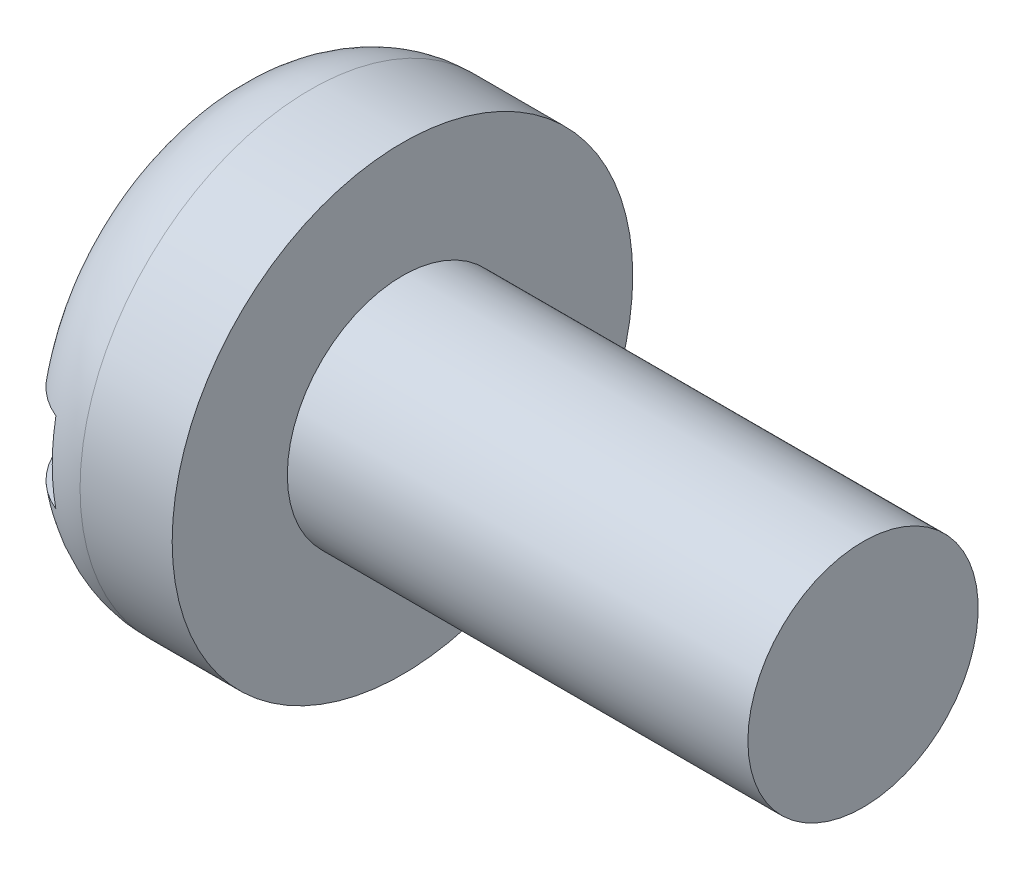
ISO-10303-21;
HEADER;
FILE_DESCRIPTION(('STEP AP214'),'2;1');
FILE_NAME('part.step','',(''),(''),'','','');
FILE_SCHEMA(('AUTOMOTIVE_DESIGN { 1 0 10303 214 1 1 1 1 }'));
ENDSEC;
DATA;
#1=APPLICATION_CONTEXT('core data for automotive mechanical design processes');
#2=APPLICATION_PROTOCOL_DEFINITION('international standard','automotive_design',2000,#1);
#3=PRODUCT_CONTEXT('',#1,'mechanical');
#4=PRODUCT('Part','Part','',(#3));
#5=PRODUCT_RELATED_PRODUCT_CATEGORY('part','',(#4));
#6=PRODUCT_DEFINITION_FORMATION('','',#4);
#7=PRODUCT_DEFINITION_CONTEXT('part definition',#1,'design');
#8=PRODUCT_DEFINITION('design','',#6,#7);
#9=PRODUCT_DEFINITION_SHAPE('','',#8);
#10=(LENGTH_UNIT() NAMED_UNIT(*) SI_UNIT(.MILLI.,.METRE.));
#11=(NAMED_UNIT(*) PLANE_ANGLE_UNIT() SI_UNIT($,.RADIAN.));
#12=(NAMED_UNIT(*) SI_UNIT($,.STERADIAN.) SOLID_ANGLE_UNIT());
#13=UNCERTAINTY_MEASURE_WITH_UNIT(LENGTH_MEASURE(1.E-05),#10,'distance_accuracy_value','');
#14=(GEOMETRIC_REPRESENTATION_CONTEXT(3) GLOBAL_UNCERTAINTY_ASSIGNED_CONTEXT((#13)) GLOBAL_UNIT_ASSIGNED_CONTEXT((#10,
#11,#12)) REPRESENTATION_CONTEXT('',''));
#15=CARTESIAN_POINT('',(0.,0.,0.));
#16=DIRECTION('',(0.,0.,1.));
#17=DIRECTION('',(1.,0.,0.));
#18=AXIS2_PLACEMENT_3D('',#15,#16,#17);
#19=CARTESIAN_POINT('',(0.,0.,0.));
#20=DIRECTION('',(-1.,0.,0.));
#21=DIRECTION('',(0.,0.,1.));
#22=AXIS2_PLACEMENT_3D('',#19,#20,#21);
#23=PLANE('',#22);
#24=DIRECTION('',(0.,0.,-1.));
#25=VECTOR('',#24,1.);
#26=CARTESIAN_POINT('',(0.,0.35,2.));
#27=LINE('',#26,#25);
#28=CARTESIAN_POINT('',(0.,0.35,1.1478240283249));
#29=VERTEX_POINT('',#28);
#30=CARTESIAN_POINT('',(0.,0.35,-1.1478240283249));
#31=VERTEX_POINT('',#30);
#32=EDGE_CURVE('E83',#29,#31,#27,.T.);
#33=ORIENTED_EDGE('',*,*,#32,.F.);
#34=CARTESIAN_POINT('',(0.,0.,0.));
#35=DIRECTION('',(-1.,0.,0.));
#36=DIRECTION('',(0.,0.,1.));
#37=AXIS2_PLACEMENT_3D('',#34,#35,#36);
#38=CIRCLE('',#37,1.2);
#39=EDGE_CURVE('E90',#29,#31,#38,.T.);
#40=ORIENTED_EDGE('',*,*,#39,.T.);
#41=EDGE_LOOP('',(#33,#40));
#42=FACE_BOUND('',#41,.T.);
#43=ADVANCED_FACE('F30',(#42),#23,.T.);
#44=CARTESIAN_POINT('',(-25.4,0.,0.));
#45=DIRECTION('',(-1.,0.,0.));
#46=DIRECTION('',(0.,0.,1.));
#47=AXIS2_PLACEMENT_3D('',#44,#45,#46);
#48=CYLINDRICAL_SURFACE('',#47,1.);
#49=CARTESIAN_POINT('',(5.6,0.,0.));
#50=DIRECTION('',(-1.,0.,0.));
#51=DIRECTION('',(0.,0.,1.));
#52=AXIS2_PLACEMENT_3D('',#49,#50,#51);
#53=CIRCLE('',#52,1.);
#54=CARTESIAN_POINT('',(5.6,0.,1.));
#55=VERTEX_POINT('',#54);
#56=EDGE_CURVE('E94',#55,#55,#53,.T.);
#57=ORIENTED_EDGE('',*,*,#56,.T.);
#58=EDGE_LOOP('',(#57));
#59=FACE_BOUND('',#58,.T.);
#60=CARTESIAN_POINT('',(1.6,0.,0.));
#61=DIRECTION('',(-1.,0.,0.));
#62=DIRECTION('',(0.,0.,1.));
#63=AXIS2_PLACEMENT_3D('',#60,#61,#62);
#64=CIRCLE('',#63,1.);
#65=CARTESIAN_POINT('',(1.6,0.,1.));
#66=VERTEX_POINT('',#65);
#67=EDGE_CURVE('E157',#66,#66,#64,.T.);
#68=ORIENTED_EDGE('',*,*,#67,.F.);
#69=EDGE_LOOP('',(#68));
#70=FACE_BOUND('',#69,.T.);
#71=ADVANCED_FACE('F32',(#59,#70),#48,.T.);
#72=CARTESIAN_POINT('',(5.6,1.,0.));
#73=DIRECTION('',(1.,0.,0.));
#74=DIRECTION('',(0.,0.,-1.));
#75=AXIS2_PLACEMENT_3D('',#72,#73,#74);
#76=PLANE('',#75);
#77=ORIENTED_EDGE('',*,*,#56,.F.);
#78=EDGE_LOOP('',(#77));
#79=FACE_BOUND('',#78,.T.);
#80=ADVANCED_FACE('F143',(#79),#76,.T.);
#81=DIRECTION('',(0.,0.,1.));
#82=VECTOR('',#81,1.);
#83=CARTESIAN_POINT('',(0.,-0.35,-2.));
#84=LINE('',#83,#82);
#85=CARTESIAN_POINT('',(0.,-0.35,-1.1478240283249));
#86=VERTEX_POINT('',#85);
#87=CARTESIAN_POINT('',(0.,-0.35,1.1478240283249));
#88=VERTEX_POINT('',#87);
#89=EDGE_CURVE('E74',#86,#88,#84,.T.);
#90=ORIENTED_EDGE('',*,*,#89,.F.);
#91=EDGE_CURVE('E81',#86,#88,#38,.T.);
#92=ORIENTED_EDGE('',*,*,#91,.T.);
#93=EDGE_LOOP('',(#90,#92));
#94=FACE_BOUND('',#93,.T.);
#95=ADVANCED_FACE('F80',(#94),#23,.T.);
#96=CARTESIAN_POINT('',(0.8,0.,0.));
#97=DIRECTION('',(-1.,0.,0.));
#98=DIRECTION('',(0.,0.,1.));
#99=AXIS2_PLACEMENT_3D('',#96,#97,#98);
#100=TOROIDAL_SURFACE('',#99,1.2,0.8);
#101=CARTESIAN_POINT('',(0.251886964657837,0.35,-1.74803308552626));
#102=CARTESIAN_POINT('',(0.284106185967298,0.35,-1.77894053000279));
#103=CARTESIAN_POINT('',(0.318913450421899,0.35,-1.80714880480359));
#104=CARTESIAN_POINT('',(0.392764045602644,0.35,-1.85733761284793));
#105=CARTESIAN_POINT('',(0.431807289219085,0.35,-1.87931827412407));
#106=CARTESIAN_POINT('',(0.513054117775202,0.35,-1.9163987096586));
#107=CARTESIAN_POINT('',(0.55525887745742,0.35,-1.93149591127619));
#108=CARTESIAN_POINT('',(0.641613804091031,0.35,-1.95434046759959));
#109=CARTESIAN_POINT('',(0.685763953570048,0.35,-1.96208788830284));
#110=CARTESIAN_POINT('',(0.774465039534947,0.35,-1.96997317784989));
#111=CARTESIAN_POINT('',(0.819011860168049,0.35,-1.97015740214389));
#112=CARTESIAN_POINT('',(0.90750040124656,0.35,-1.96302819944338));
#113=CARTESIAN_POINT('',(0.951442136442558,0.35,-1.95571495554893));
#114=CARTESIAN_POINT('',(1.03738817570387,0.35,-1.93383211970242));
#115=CARTESIAN_POINT('',(1.07939605807564,0.35,-1.9192765710464));
#116=CARTESIAN_POINT('',(1.16038685065351,0.35,-1.88334999333501));
#117=CARTESIAN_POINT('',(1.19936974149271,0.35,-1.8619789206491));
#118=CARTESIAN_POINT('',(1.27340405982753,0.35,-1.81294134542017));
#119=CARTESIAN_POINT('',(1.30843691171087,0.35,-1.78524681138814));
#120=CARTESIAN_POINT('',(1.3734217227307,0.35,-1.72443226985518));
#121=CARTESIAN_POINT('',(1.40337349922101,0.35,-1.6913120674053));
#122=CARTESIAN_POINT('',(1.45774858221193,0.35,-1.62017981586091));
#123=CARTESIAN_POINT('',(1.48210165087369,0.35,-1.58211410752388));
#124=CARTESIAN_POINT('',(1.52422592481682,0.35,-1.50250494859893));
#125=CARTESIAN_POINT('',(1.54199667449503,0.35,-1.46096125752214));
#126=CARTESIAN_POINT('',(1.57090761777223,0.35,-1.37460737714393));
#127=CARTESIAN_POINT('',(1.58189252649972,0.35,-1.32974527505676));
#128=CARTESIAN_POINT('',(1.59646688779068,0.35,-1.23884208305886));
#129=CARTESIAN_POINT('',(1.6000553878534,0.35,-1.19280084207285));
#130=CARTESIAN_POINT('',(1.5999412075827,0.35,-1.09898565568804));
#131=CARTESIAN_POINT('',(1.59595668889672,0.35,-1.05121225585408));
#132=CARTESIAN_POINT('',(1.58051554138408,0.35,-0.956902000850774));
#133=CARTESIAN_POINT('',(1.56905773634552,0.35,-0.910365341530719));
#134=CARTESIAN_POINT('',(1.53830789967697,0.35,-0.816640030751649));
#135=CARTESIAN_POINT('',(1.51855977053689,0.35,-0.769601634389602));
#136=CARTESIAN_POINT('',(1.47218777566415,0.35,-0.679051431491683));
#137=CARTESIAN_POINT('',(1.44556043666615,0.35,-0.635541421036113));
#138=CARTESIAN_POINT('',(1.38324599534595,0.35,-0.548261155230435));
#139=CARTESIAN_POINT('',(1.34689115451158,0.35,-0.504969922477862));
#140=CARTESIAN_POINT('',(1.26825683235819,0.35,-0.424127509198641));
#141=CARTESIAN_POINT('',(1.22597536047846,0.35,-0.386578266114273));
#142=CARTESIAN_POINT('',(1.15072803576559,0.35,-0.32910608498835));
#143=CARTESIAN_POINT('',(1.1191159360726,0.35,-0.307389624915311));
#144=CARTESIAN_POINT('',(1.05351876701516,0.35,-0.26776562627417));
#145=CARTESIAN_POINT('',(1.0195345845723,0.35,-0.249856674105417));
#146=CARTESIAN_POINT('',(0.96065969889161,0.35,-0.224864244714228));
#147=CARTESIAN_POINT('',(0.936473030909389,0.35,-0.216158945746235));
#148=CARTESIAN_POINT('',(0.887106020835857,0.35,-0.202605206674377));
#149=CARTESIAN_POINT('',(0.86193133431849,0.35,-0.197737448444988));
#150=CARTESIAN_POINT('',(0.810783523452729,0.35,-0.192964320373583));
#151=CARTESIAN_POINT('',(0.784804569164351,0.35,-0.193116141966727));
#152=CARTESIAN_POINT('',(0.733333382405487,0.35,-0.198492404966462));
#153=CARTESIAN_POINT('',(0.707843238721914,0.35,-0.203735105092492));
#154=CARTESIAN_POINT('',(0.647580830029514,0.35,-0.220980976114015));
#155=CARTESIAN_POINT('',(0.613385828058062,0.35,-0.234894679368622));
#156=CARTESIAN_POINT('',(0.547202579431893,0.35,-0.267318959267038));
#157=CARTESIAN_POINT('',(0.51522497923907,0.35,-0.285849982076015));
#158=CARTESIAN_POINT('',(0.457751191162357,0.35,-0.323360437607254));
#159=CARTESIAN_POINT('',(0.431974418523538,0.35,-0.341913766343738));
#160=CARTESIAN_POINT('',(0.382049961938393,0.35,-0.3811030519923));
#161=CARTESIAN_POINT('',(0.357903152418431,0.35,-0.401740112179063));
#162=CARTESIAN_POINT('',(0.288179326044528,0.35,-0.466439063976135));
#163=CARTESIAN_POINT('',(0.245194257247048,0.35,-0.513371453045039));
#164=CARTESIAN_POINT('',(0.167811086718386,0.35,-0.614139929718161));
#165=CARTESIAN_POINT('',(0.133444025504299,0.35,-0.667999945117915));
#166=CARTESIAN_POINT('',(0.0754909814267591,0.35,-0.781273194679886));
#167=CARTESIAN_POINT('',(0.0518963876977758,0.35,-0.840681947591701));
#168=CARTESIAN_POINT('',(0.0190222494183726,0.35,-0.956707799344828));
#169=CARTESIAN_POINT('',(0.0085119690208978,0.35,-1.01297553527392));
#170=CARTESIAN_POINT('',(-0.00156617385624804,0.35,-1.1264972793032));
#171=CARTESIAN_POINT('',(-0.0011405005997677,0.35,-1.18375068477026));
#172=CARTESIAN_POINT('',(0.0103252237888666,0.35,-1.29044131812036));
#173=CARTESIAN_POINT('',(0.0201263192310197,0.35,-1.34001381873846));
#174=CARTESIAN_POINT('',(0.0484733760745189,0.35,-1.43658734244354));
#175=CARTESIAN_POINT('',(0.067014186401646,0.35,-1.48358986205711));
#176=CARTESIAN_POINT('',(0.110304018114758,0.35,-1.56930412679726));
#177=CARTESIAN_POINT('',(0.134333018852264,0.35,-1.60838106104874));
#178=CARTESIAN_POINT('',(0.188633996751165,0.35,-1.68192512177213));
#179=CARTESIAN_POINT('',(0.218904417878551,0.35,-1.71639339369497));
#180=CARTESIAN_POINT('',(0.251886964657837,0.35,-1.74803308552626));
#181=B_SPLINE_CURVE_WITH_KNOTS('',3,(#101,#102,#103,#104,#105,#106,#107,#108,#109,#110,#111,
#112,#113,#114,#115,#116,#117,#118,#119,#120,#121,#122,#123,#124,#125,#126,#127,#128,#129,#130,
#131,#132,#133,#134,#135,#136,#137,#138,#139,#140,#141,#142,#143,#144,#145,#146,#147,#148,#149,
#150,#151,#152,#153,#154,#155,#156,#157,#158,#159,#160,#161,#162,#163,#164,#165,#166,#167,#168,
#169,#170,#171,#172,#173,#174,#175,#176,#177,#178,#179,#180),.UNSPECIFIED.,.T.,.F.,(4,2,2,2,2,2,
2,2,2,2,2,2,2,2,2,2,2,2,2,2,2,2,2,2,2,2,2,2,2,2,2,2,2,2,2,2,2,2,2,4),(0.,0.133781315953334,
0.267559881316518,0.40138840450072,0.535215725958765,0.668222685556049,0.801226396989754,
0.933973204884136,1.06672086259302,1.20006881741932,1.33342156460409,1.46836564383989,
1.60331906164843,1.7412562268888,1.8792111544044,2.02240092222392,2.16561323195522,
2.31802799031968,2.4705198527409,2.63947463197752,2.80848629415617,2.92336541035193,
3.03820180099507,3.11510771424948,3.19162396716318,3.26901231824847,3.34667925604037,
3.45683323750344,3.56748394622507,3.66264122884862,3.75784916132582,3.94782137520883,
4.13846831229046,4.32896258966869,4.49970272787686,4.67034194357478,4.82115579156899,
4.97188086277274,5.10886578469081,5.24581659642038),.UNSPECIFIED.);
#182=CARTESIAN_POINT('',(0.5,0.35,-1.90981350840938));
#183=VERTEX_POINT('',#182);
#184=EDGE_CURVE('E11',#31,#183,#181,.T.);
#185=ORIENTED_EDGE('',*,*,#184,.F.);
#186=ORIENTED_EDGE('',*,*,#39,.F.);
#187=CARTESIAN_POINT('',(0.350977851468429,0.35,0.408453444572131));
#188=CARTESIAN_POINT('',(0.372851901364005,0.35,0.388917069294482));
#189=CARTESIAN_POINT('',(0.39546426920051,0.35,0.370208015137125));
#190=CARTESIAN_POINT('',(0.442071446476166,0.35,0.334600843981868));
#191=CARTESIAN_POINT('',(0.466066025830973,0.35,0.317702426915198));
#192=CARTESIAN_POINT('',(0.515379769405964,0.35,0.286051069189248));
#193=CARTESIAN_POINT('',(0.540696443015857,0.35,0.271294279167221));
#194=CARTESIAN_POINT('',(0.592726274168692,0.35,0.244555552222736));
#195=CARTESIAN_POINT('',(0.619436397200964,0.35,0.232567870793255));
#196=CARTESIAN_POINT('',(0.671056346977196,0.35,0.213819831943527));
#197=CARTESIAN_POINT('',(0.695793430035889,0.35,0.206602721354671));
#198=CARTESIAN_POINT('',(0.746045512829101,0.35,0.196633562437337));
#199=CARTESIAN_POINT('',(0.77155414080496,0.35,0.193851728370853));
#200=CARTESIAN_POINT('',(0.82275068982649,0.35,0.193467533801252));
#201=CARTESIAN_POINT('',(0.848438844927093,0.35,0.195892683244416));
#202=CARTESIAN_POINT('',(0.899057552429843,0.35,0.205289524163584));
#203=CARTESIAN_POINT('',(0.923982581358135,0.35,0.212288632297425));
#204=CARTESIAN_POINT('',(0.987885848906531,0.35,0.234847057685716));
#205=CARTESIAN_POINT('',(1.02590578322928,0.35,0.253022420803988));
#206=CARTESIAN_POINT('',(1.09911347168102,0.35,0.294330673022862));
#207=CARTESIAN_POINT('',(1.13429275041329,0.35,0.317477694396758));
#208=CARTESIAN_POINT('',(1.21975887301846,0.35,0.380794824839855));
#209=CARTESIAN_POINT('',(1.26820018803985,0.35,0.42349508281329));
#210=CARTESIAN_POINT('',(1.35726570645268,0.35,0.516275193972676));
#211=CARTESIAN_POINT('',(1.39790020209352,0.35,0.566345175107624));
#212=CARTESIAN_POINT('',(1.46922610141638,0.35,0.672658387858806));
#213=CARTESIAN_POINT('',(1.4999901285951,0.35,0.728852254289575));
#214=CARTESIAN_POINT('',(1.54999742126348,0.35,0.846186841236173));
#215=CARTESIAN_POINT('',(1.56924794827696,0.35,0.907324416089533));
#216=CARTESIAN_POINT('',(1.59299302522483,0.35,1.02410639615917));
#217=CARTESIAN_POINT('',(1.59908512418509,0.35,1.0794267563778));
#218=CARTESIAN_POINT('',(1.6007218488715,0.35,1.19022623290114));
#219=CARTESIAN_POINT('',(1.59627399396923,0.35,1.24570520784179));
#220=CARTESIAN_POINT('',(1.57770680090785,0.35,1.34895835668443));
#221=CARTESIAN_POINT('',(1.56465952664663,0.35,1.39692705392826));
#222=CARTESIAN_POINT('',(1.53022815270588,0.35,1.48977349958171));
#223=CARTESIAN_POINT('',(1.50884736716254,0.35,1.53465246840092));
#224=CARTESIAN_POINT('',(1.4597125306159,0.35,1.61744214548773));
#225=CARTESIAN_POINT('',(1.43237537138467,0.35,1.65560073975272));
#226=CARTESIAN_POINT('',(1.37150367487677,0.35,1.72660667528119));
#227=CARTESIAN_POINT('',(1.33797027938671,0.35,1.75945499298713));
#228=CARTESIAN_POINT('',(1.26674657256152,0.35,1.81791134155538));
#229=CARTESIAN_POINT('',(1.22920771622245,0.35,1.84370406636851));
#230=CARTESIAN_POINT('',(1.15027758316976,0.35,1.8885025229603));
#231=CARTESIAN_POINT('',(1.10888669167432,0.35,1.90750893247886));
#232=CARTESIAN_POINT('',(1.02413562245708,0.35,1.93790256562018));
#233=CARTESIAN_POINT('',(0.980816844208758,0.35,1.94940532464718));
#234=CARTESIAN_POINT('',(0.89285808082051,0.35,1.96491723607863));
#235=CARTESIAN_POINT('',(0.848218161337581,0.35,1.96892676024264));
#236=CARTESIAN_POINT('',(0.759222098868095,0.35,1.9693294338378));
#237=CARTESIAN_POINT('',(0.714866188667454,0.35,1.96577639906961));
#238=CARTESIAN_POINT('',(0.627382352553998,0.35,1.95127037053508));
#239=CARTESIAN_POINT('',(0.584254407753625,0.35,1.94031749065124));
#240=CARTESIAN_POINT('',(0.50045966061888,0.35,1.91134458732121));
#241=CARTESIAN_POINT('',(0.459792019050226,0.35,1.89332698959064));
#242=CARTESIAN_POINT('',(0.38203434798137,0.35,1.85076012753146));
#243=CARTESIAN_POINT('',(0.344944369593396,0.35,1.8262107699058));
#244=CARTESIAN_POINT('',(0.275135002917945,0.35,1.77113062108276));
#245=CARTESIAN_POINT('',(0.24244421542999,0.35,1.74056359772568));
#246=CARTESIAN_POINT('',(0.182574611431861,0.35,1.67444307985153));
#247=CARTESIAN_POINT('',(0.155395999921071,0.35,1.63888939996243));
#248=CARTESIAN_POINT('',(0.106888595411345,0.35,1.56328438701898));
#249=CARTESIAN_POINT('',(0.0856476998044146,0.35,1.52317669936974));
#250=CARTESIAN_POINT('',(0.050016614604032,0.35,1.44002927232828));
#251=CARTESIAN_POINT('',(0.0356272097608824,0.35,1.39698919771383));
#252=CARTESIAN_POINT('',(0.0136769708883334,0.35,1.30804309433586));
#253=CARTESIAN_POINT('',(0.0062990528043404,0.35,1.2620920213093));
#254=CARTESIAN_POINT('',(-0.000971874358881088,0.35,1.169616053027));
#255=CARTESIAN_POINT('',(-0.000864956653330991,0.35,1.12309116338868));
#256=CARTESIAN_POINT('',(0.00676280526935644,0.35,1.02864456896464));
#257=CARTESIAN_POINT('',(0.0146024100665218,0.35,0.980748881743694));
#258=CARTESIAN_POINT('',(0.0376656486439348,0.35,0.8867521642164));
#259=CARTESIAN_POINT('',(0.0528951653956638,0.35,0.840652595406423));
#260=CARTESIAN_POINT('',(0.0914025057134252,0.35,0.747924748538624));
#261=CARTESIAN_POINT('',(0.115193290538505,0.35,0.701510639327006));
#262=CARTESIAN_POINT('',(0.16938763226242,0.35,0.612843561436552));
#263=CARTESIAN_POINT('',(0.199780152555149,0.35,0.570583816847892));
#264=CARTESIAN_POINT('',(0.251028294116639,0.35,0.508889201972213));
#265=CARTESIAN_POINT('',(0.269944963009819,0.35,0.487805968011426));
#266=CARTESIAN_POINT('',(0.309334088307438,0.35,0.44703899981075));
#267=CARTESIAN_POINT('',(0.329810271423262,0.35,0.427358850267747));
#268=CARTESIAN_POINT('',(0.350977851468429,0.35,0.408453444572131));
#269=B_SPLINE_CURVE_WITH_KNOTS('',3,(#187,#188,#189,#190,#191,#192,#193,#194,#195,#196,#197,
#198,#199,#200,#201,#202,#203,#204,#205,#206,#207,#208,#209,#210,#211,#212,#213,#214,#215,#216,
#217,#218,#219,#220,#221,#222,#223,#224,#225,#226,#227,#228,#229,#230,#231,#232,#233,#234,#235,
#236,#237,#238,#239,#240,#241,#242,#243,#244,#245,#246,#247,#248,#249,#250,#251,#252,#253,#254,
#255,#256,#257,#258,#259,#260,#261,#262,#263,#264,#265,#266,#267,#268),.UNSPECIFIED.,.T.,.F.,(4,
2,2,2,2,2,2,2,2,2,2,2,2,2,2,2,2,2,2,2,2,2,2,2,2,2,2,2,2,2,2,2,2,2,2,2,2,2,2,2,4),(0.,
0.0879625200291612,0.175910439803122,0.263698270307671,0.351302316106764,0.428315357879815,
0.504808995427511,0.5817077642863,0.659071751035697,0.784811835338449,0.91091418976343,
1.10368375774537,1.29619741410369,1.48726028669408,1.67820252918457,1.84423200230198,
2.01014306300305,2.15851584706943,2.30682968518859,2.44695762838872,2.58705977577771,
2.7230370521765,2.85900074491244,2.99281820600965,3.12662902788623,3.2594908256059,
3.39235057864914,3.52516475334554,3.65798082520858,3.79162248464802,3.92526911334753,
4.0608003932459,4.19634719278042,4.33534022990006,4.47433190741678,4.6193032196898,
4.76439013074121,4.92023309578537,5.0758175048138,5.16072939144968,5.24585097124768),.UNSPECIFIED.);
#270=CARTESIAN_POINT('',(0.5,0.35,1.90981350840938));
#271=VERTEX_POINT('',#270);
#272=EDGE_CURVE('E108',#271,#29,#269,.T.);
#273=ORIENTED_EDGE('',*,*,#272,.F.);
#274=CARTESIAN_POINT('',(0.5,0.,0.));
#275=DIRECTION('',(-1.,0.,0.));
#276=DIRECTION('',(0.,0.,1.));
#277=AXIS2_PLACEMENT_3D('',#274,#275,#276);
#278=CIRCLE('',#277,1.94161984870957);
#279=CARTESIAN_POINT('',(0.5,-0.35,1.90981350840938));
#280=VERTEX_POINT('',#279);
#281=EDGE_CURVE('E102',#271,#280,#278,.F.);
#282=ORIENTED_EDGE('',*,*,#281,.T.);
#283=CARTESIAN_POINT('',(0.350977851468428,-0.35,0.408453444572131));
#284=CARTESIAN_POINT('',(0.307541431832276,-0.35,0.447238442333054));
#285=CARTESIAN_POINT('',(0.266951951657396,-0.35,0.489339468058198));
#286=CARTESIAN_POINT('',(0.192746899177876,-0.35,0.579463474216792));
#287=CARTESIAN_POINT('',(0.159149749328757,-0.35,0.627501579757789));
#288=CARTESIAN_POINT('',(0.0984786665931023,-0.35,0.732232626674235));
#289=CARTESIAN_POINT('',(0.0720362527408136,-0.35,0.789297739755372));
#290=CARTESIAN_POINT('',(0.0308536741087963,-0.35,0.907480489579772));
#291=CARTESIAN_POINT('',(0.0160974115538003,-0.35,0.968592425517289));
#292=CARTESIAN_POINT('',(0.000673029815068922,-0.35,1.08415221599011));
#293=CARTESIAN_POINT('',(-0.0016308230997484,-0.35,1.13838325690305));
#294=CARTESIAN_POINT('',(0.00390802168322471,-0.35,1.24633559580093));
#295=CARTESIAN_POINT('',(0.0117457852742699,-0.35,1.30005712886618));
#296=CARTESIAN_POINT('',(0.0363342193296325,-0.35,1.39999782914796));
#297=CARTESIAN_POINT('',(0.052165917911657,-0.35,1.44644449059139));
#298=CARTESIAN_POINT('',(0.0917995372924641,-0.35,1.53580144182246));
#299=CARTESIAN_POINT('',(0.115598363765376,-0.35,1.57871309650916));
#300=CARTESIAN_POINT('',(0.169158724421358,-0.35,1.65756914065105));
#301=CARTESIAN_POINT('',(0.198568840269009,-0.35,1.69375259273007));
#302=CARTESIAN_POINT('',(0.263196201568035,-0.35,1.76049876189753));
#303=CARTESIAN_POINT('',(0.298412543031991,-0.35,1.79106235239346));
#304=CARTESIAN_POINT('',(0.372627740791703,-0.35,1.84487082709209));
#305=CARTESIAN_POINT('',(0.411501678586222,-0.35,1.86828814447676));
#306=CARTESIAN_POINT('',(0.492671409468932,-0.35,1.90815622766166));
#307=CARTESIAN_POINT('',(0.534966890568116,-0.35,1.92460762778916));
#308=CARTESIAN_POINT('',(0.621137453221519,-0.35,1.949856876278));
#309=CARTESIAN_POINT('',(0.664982048250167,-0.35,1.95875886371402));
#310=CARTESIAN_POINT('',(0.753544519936369,-0.35,1.96902786461851));
#311=CARTESIAN_POINT('',(0.798262359272904,-0.35,1.97039519940139));
#312=CARTESIAN_POINT('',(0.88702479965196,-0.35,1.96556817119985));
#313=CARTESIAN_POINT('',(0.931071806711311,-0.35,1.95941789362826));
#314=CARTESIAN_POINT('',(1.01750849828811,-0.35,1.93981456859494));
#315=CARTESIAN_POINT('',(1.05989819932804,-0.35,1.92636159395724));
#316=CARTESIAN_POINT('',(1.1418598033706,-0.35,1.89254119727629));
#317=CARTESIAN_POINT('',(1.18142951092607,-0.35,1.87216845762668));
#318=CARTESIAN_POINT('',(1.25661926618199,-0.35,1.82511532947288));
#319=CARTESIAN_POINT('',(1.2922392473129,-0.35,1.79843483468015));
#320=CARTESIAN_POINT('',(1.35881674740449,-0.35,1.73932767143814));
#321=CARTESIAN_POINT('',(1.38973759869316,-0.35,1.70685972084008));
#322=CARTESIAN_POINT('',(1.44578791353489,-0.35,1.63726339599232));
#323=CARTESIAN_POINT('',(1.47091704771862,-0.35,1.60013475687916));
#324=CARTESIAN_POINT('',(1.51511995617415,-0.35,1.52166058892667));
#325=CARTESIAN_POINT('',(1.53409196337102,-0.35,1.48025778241894));
#326=CARTESIAN_POINT('',(1.56502100943566,-0.35,1.39491698887763));
#327=CARTESIAN_POINT('',(1.5769776410762,-0.35,1.35097885483638));
#328=CARTESIAN_POINT('',(1.59393824231719,-0.35,1.26051769776246));
#329=CARTESIAN_POINT('',(1.59873942671379,-0.35,1.21395676715884));
#330=CARTESIAN_POINT('',(1.60082549401583,-0.35,1.12066995323077));
#331=CARTESIAN_POINT('',(1.59810837620419,-0.35,1.07394402930395));
#332=CARTESIAN_POINT('',(1.58516977283676,-0.35,0.979284791167513));
#333=CARTESIAN_POINT('',(1.57459758231123,-0.35,0.931399719990195));
#334=CARTESIAN_POINT('',(1.54616391484335,-0.35,0.837881097064492));
#335=CARTESIAN_POINT('',(1.52830360455748,-0.35,0.792247186268192));
#336=CARTESIAN_POINT('',(1.48439243058728,-0.35,0.700582517468215));
#337=CARTESIAN_POINT('',(1.45780122589256,-0.35,0.654811296278472));
#338=CARTESIAN_POINT('',(1.39811851473017,-0.35,0.567665701089075));
#339=CARTESIAN_POINT('',(1.36501585547617,-0.35,0.526299061275942));
#340=CARTESIAN_POINT('',(1.28872706310859,-0.35,0.443429582546232));
#341=CARTESIAN_POINT('',(1.24478872722491,-0.35,0.402613867770244));
#342=CARTESIAN_POINT('',(1.17460371919081,-0.35,0.346890069782737));
#343=CARTESIAN_POINT('',(1.15049139683479,-0.35,0.329229599421822));
#344=CARTESIAN_POINT('',(1.10086203432916,-0.35,0.296021273407181));
#345=CARTESIAN_POINT('',(1.07534626495564,-0.35,0.280471549390627));
#346=CARTESIAN_POINT('',(1.02463387893405,-0.35,0.253025163593232));
#347=CARTESIAN_POINT('',(0.999534119078463,-0.35,0.240951716080483));
#348=CARTESIAN_POINT('',(0.948022256273408,-0.35,0.220119977789011));
#349=CARTESIAN_POINT('',(0.921614555027773,-0.35,0.211351322728958));
#350=CARTESIAN_POINT('',(0.872247440278061,-0.35,0.199730654766415));
#351=CARTESIAN_POINT('',(0.849475322338036,-0.35,0.196120826317477));
#352=CARTESIAN_POINT('',(0.803668801254879,-0.35,0.192997808588616));
#353=CARTESIAN_POINT('',(0.780634911494813,-0.35,0.193477645180807));
#354=CARTESIAN_POINT('',(0.735133296008913,-0.35,0.198383168211637));
#355=CARTESIAN_POINT('',(0.712663401365281,-0.35,0.202790108533792));
#356=CARTESIAN_POINT('',(0.668504698451256,-0.35,0.214681786487084));
#357=CARTESIAN_POINT('',(0.646819181494444,-0.35,0.22217815201811));
#358=CARTESIAN_POINT('',(0.603867095482844,-0.35,0.239605866749258));
#359=CARTESIAN_POINT('',(0.582623000510497,-0.35,0.249591235887116));
#360=CARTESIAN_POINT('',(0.541042240022775,-0.35,0.271314260533188));
#361=CARTESIAN_POINT('',(0.520706554352116,-0.35,0.283053751519545));
#362=CARTESIAN_POINT('',(0.461028608478225,-0.35,0.320346120154181));
#363=CARTESIAN_POINT('',(0.422969891101245,-0.35,0.347993211611804));
#364=CARTESIAN_POINT('',(0.374625115329434,-0.35,0.38776495108432));
#365=CARTESIAN_POINT('',(0.362697851039081,-0.35,0.397988490026765));
#366=CARTESIAN_POINT('',(0.350977851468428,-0.35,0.408453444572131));
#367=B_SPLINE_CURVE_WITH_KNOTS('',3,(#283,#284,#285,#286,#287,#288,#289,#290,#291,#292,#293,
#294,#295,#296,#297,#298,#299,#300,#301,#302,#303,#304,#305,#306,#307,#308,#309,#310,#311,#312,
#313,#314,#315,#316,#317,#318,#319,#320,#321,#322,#323,#324,#325,#326,#327,#328,#329,#330,#331,
#332,#333,#334,#335,#336,#337,#338,#339,#340,#341,#342,#343,#344,#345,#346,#347,#348,#349,#350,
#351,#352,#353,#354,#355,#356,#357,#358,#359,#360,#361,#362,#363,#364,#365,#366),.UNSPECIFIED.,
.T.,.F.,(4,2,2,2,2,2,2,2,2,2,2,2,2,2,2,2,2,2,2,2,2,2,2,2,2,2,2,2,2,2,2,2,2,2,2,2,2,2,2,2,2,4),
(0.,0.174667047687547,0.349788616471309,0.537328421616047,0.724609437496931,0.886556203352354,
1.04842420836501,1.19489125954039,1.34130149074236,1.48050049918449,1.61967785577594,
1.7551682152312,1.89064623406863,2.02422353300082,2.15779513550023,2.29058718023651,
2.42337790076696,2.55627089823924,2.68916613517847,2.82305029847094,2.95694207374817,
3.09294580352988,3.22895742725028,3.36875482758447,3.50858943338538,3.65507347755286,
3.80153408226464,3.95969513817674,4.11812948814493,4.29724567125298,4.38683381410154,
4.47634213204504,4.55974759570922,4.64288926771534,4.71174303715314,4.78047941340967,
4.84888942231848,4.91755929727061,4.98787388231274,5.05826256516769,5.19889158648497,
5.24602018826783),.UNSPECIFIED.);
#368=EDGE_CURVE('E89',#88,#280,#367,.T.);
#369=ORIENTED_EDGE('',*,*,#368,.F.);
#370=ORIENTED_EDGE('',*,*,#91,.F.);
#371=CARTESIAN_POINT('',(0.251886964657837,-0.35,-1.74803308552626));
#372=CARTESIAN_POINT('',(0.218817460513611,-0.35,-1.71630723386129));
#373=CARTESIAN_POINT('',(0.188442782200808,-0.35,-1.68170659931342));
#374=CARTESIAN_POINT('',(0.133954954239766,-0.35,-1.60782805390751));
#375=CARTESIAN_POINT('',(0.109852459912844,-0.35,-1.56854234688845));
#376=CARTESIAN_POINT('',(0.0685858315543035,-0.35,-1.48656659259656));
#377=CARTESIAN_POINT('',(0.0514098859958479,-0.35,-1.44388249060683));
#378=CARTESIAN_POINT('',(0.0242998547097917,-0.35,-1.35630204432842));
#379=CARTESIAN_POINT('',(0.014363028596391,-0.35,-1.31140654404816));
#380=CARTESIAN_POINT('',(0.00167493863727364,-0.35,-1.21955214913301));
#381=CARTESIAN_POINT('',(-0.000903799590996353,-0.35,-1.1725695496942));
#382=CARTESIAN_POINT('',(0.00146376498450522,-0.35,-1.07879045387018));
#383=CARTESIAN_POINT('',(0.00641332511068747,-0.35,-1.031994046831));
#384=CARTESIAN_POINT('',(0.0238943412427644,-0.35,-0.937344733549899));
#385=CARTESIAN_POINT('',(0.0368041293037588,-0.35,-0.889562062191883));
#386=CARTESIAN_POINT('',(0.0698187710789661,-0.35,-0.796607167159227));
#387=CARTESIAN_POINT('',(0.0899201510958502,-0.35,-0.751433695397616));
#388=CARTESIAN_POINT('',(0.138473544174913,-0.35,-0.66075783594746));
#389=CARTESIAN_POINT('',(0.167494864148162,-0.35,-0.615560994326876));
#390=CARTESIAN_POINT('',(0.231919692894369,-0.35,-0.529838592240865));
#391=CARTESIAN_POINT('',(0.267340861756004,-0.35,-0.489326479551816));
#392=CARTESIAN_POINT('',(0.348700903475067,-0.35,-0.408307742933772));
#393=CARTESIAN_POINT('',(0.395416545291009,-0.35,-0.368571690666443));
#394=CARTESIAN_POINT('',(0.469823903507998,-0.35,-0.315138795051813));
#395=CARTESIAN_POINT('',(0.495344846903615,-0.35,-0.298358252673444));
#396=CARTESIAN_POINT('',(0.547869334352344,-0.35,-0.267332718781432));
#397=CARTESIAN_POINT('',(0.574870621937722,-0.35,-0.253084001330237));
#398=CARTESIAN_POINT('',(0.626852208120069,-0.35,-0.229731581129571));
#399=CARTESIAN_POINT('',(0.651635084064024,-0.35,-0.220198739316877));
#400=CARTESIAN_POINT('',(0.702266774172352,-0.35,-0.205037511073876));
#401=CARTESIAN_POINT('',(0.728107781478857,-0.35,-0.199384609363179));
#402=CARTESIAN_POINT('',(0.780825250469768,-0.35,-0.193243417669991));
#403=CARTESIAN_POINT('',(0.807711184180639,-0.35,-0.192829239123298));
#404=CARTESIAN_POINT('',(0.861051814301958,-0.35,-0.197513453671157));
#405=CARTESIAN_POINT('',(0.88750446955039,-0.35,-0.202632923872863));
#406=CARTESIAN_POINT('',(0.948215146276492,-0.35,-0.219500603693114));
#407=CARTESIAN_POINT('',(0.981973798817242,-0.35,-0.232939111325285));
#408=CARTESIAN_POINT('',(1.04734672810601,-0.35,-0.264375807725807));
#409=CARTESIAN_POINT('',(1.07895058753815,-0.35,-0.282394395160462));
#410=CARTESIAN_POINT('',(1.13609184873635,-0.35,-0.319102891613526));
#411=CARTESIAN_POINT('',(1.16188366407925,-0.35,-0.337400714285152));
#412=CARTESIAN_POINT('',(1.21185960263519,-0.35,-0.376081280506154));
#413=CARTESIAN_POINT('',(1.2360428389527,-0.35,-0.396465158743067));
#414=CARTESIAN_POINT('',(1.30592077467626,-0.35,-0.460397449242269));
#415=CARTESIAN_POINT('',(1.34906667659048,-0.35,-0.506807030981278));
#416=CARTESIAN_POINT('',(1.42703676073571,-0.35,-0.606639677522798));
#417=CARTESIAN_POINT('',(1.46180850746529,-0.35,-0.66010384688985));
#418=CARTESIAN_POINT('',(1.52070243585016,-0.35,-0.772641895888023));
#419=CARTESIAN_POINT('',(1.54483310992527,-0.35,-0.83171125621018));
#420=CARTESIAN_POINT('',(1.57892864452508,-0.35,-0.947500037627884));
#421=CARTESIAN_POINT('',(1.59005641564509,-0.35,-1.00387614217443));
#422=CARTESIAN_POINT('',(1.60131974094067,-0.35,-1.11773046470933));
#423=CARTESIAN_POINT('',(1.60146190293029,-0.35,-1.17520799937713));
#424=CARTESIAN_POINT('',(1.59099642208525,-0.35,-1.2823411463385));
#425=CARTESIAN_POINT('',(1.58165028208887,-0.35,-1.33212209238904));
#426=CARTESIAN_POINT('',(1.55415800483624,-0.35,-1.42919018058866));
#427=CARTESIAN_POINT('',(1.5360162671822,-0.35,-1.47647855643623));
#428=CARTESIAN_POINT('',(1.49280341641367,-0.35,-1.56404183013144));
#429=CARTESIAN_POINT('',(1.46824757307855,-0.35,-1.60457163221228));
#430=CARTESIAN_POINT('',(1.41245707543743,-0.35,-1.68074150409086));
#431=CARTESIAN_POINT('',(1.381223800045,-0.35,-1.71638258093713));
#432=CARTESIAN_POINT('',(1.31413061531505,-0.35,-1.7805201722249));
#433=CARTESIAN_POINT('',(1.2784617785933,-0.35,-1.80921675827563));
#434=CARTESIAN_POINT('',(1.20273842550185,-0.35,-1.86008196576711));
#435=CARTESIAN_POINT('',(1.16268439877505,-0.35,-1.88225131501035));
#436=CARTESIAN_POINT('',(1.08011920065254,-0.35,-1.91903175729501));
#437=CARTESIAN_POINT('',(1.03766591148675,-0.35,-1.93377288557866));
#438=CARTESIAN_POINT('',(0.950877671892526,-0.35,-1.95584714681287));
#439=CARTESIAN_POINT('',(0.906542930727583,-0.35,-1.96318110138382));
#440=CARTESIAN_POINT('',(0.817670440792568,-0.35,-1.97018806508642));
#441=CARTESIAN_POINT('',(0.773137995964552,-0.35,-1.96992856497181));
#442=CARTESIAN_POINT('',(0.684736731358576,-0.35,-1.96192100117552));
#443=CARTESIAN_POINT('',(0.640868111032683,-0.35,-1.95417073048249));
#444=CARTESIAN_POINT('',(0.555111397174593,-0.35,-1.93142908451991));
#445=CARTESIAN_POINT('',(0.513221067507688,-0.35,-1.91644611067972));
#446=CARTESIAN_POINT('',(0.432581297078133,-0.35,-1.87969993854261));
#447=CARTESIAN_POINT('',(0.393827255468828,-0.35,-1.85794690755158));
#448=CARTESIAN_POINT('',(0.338462135608715,-0.35,-1.82048892896275));
#449=CARTESIAN_POINT('',(0.3202930937192,-0.35,-1.80703101212684));
#450=CARTESIAN_POINT('',(0.285159900434859,-0.35,-1.77862613311482));
#451=CARTESIAN_POINT('',(0.26819572442017,-0.35,-1.76367920137979));
#452=CARTESIAN_POINT('',(0.251886964657837,-0.35,-1.74803308552626));
#453=B_SPLINE_CURVE_WITH_KNOTS('',3,(#371,#372,#373,#374,#375,#376,#377,#378,#379,#380,#381,
#382,#383,#384,#385,#386,#387,#388,#389,#390,#391,#392,#393,#394,#395,#396,#397,#398,#399,#400,
#401,#402,#403,#404,#405,#406,#407,#408,#409,#410,#411,#412,#413,#414,#415,#416,#417,#418,#419,
#420,#421,#422,#423,#424,#425,#426,#427,#428,#429,#430,#431,#432,#433,#434,#435,#436,#437,#438,
#439,#440,#441,#442,#443,#444,#445,#446,#447,#448,#449,#450,#451,#452),.UNSPECIFIED.,.T.,.F.,(4,
2,2,2,2,2,2,2,2,2,2,2,2,2,2,2,2,2,2,2,2,2,2,2,2,2,2,2,2,2,2,2,2,2,2,2,2,2,2,2,4),(0.,
0.137395594550943,0.275023098034197,0.412414909014415,0.549754682935448,0.69028921959176,
0.830884579625661,0.978740321680282,1.12652474236265,1.28701325639291,1.44795158949692,
1.6310749643619,1.72261136151829,1.81401191368564,1.89346066920989,1.97240269113451,
2.05246026511274,2.13282384828581,2.24124549127591,2.35015875047745,2.44490717846367,
2.53970742056493,2.72887198593232,2.9191918993045,3.10935964618161,3.28076151032207,
3.45206027590386,3.60322562614961,3.75431544061684,3.89577666448087,4.03720870426474,
4.17388113041854,4.31053831149432,4.4447120083492,4.57887082072009,4.7118375925017,
4.84484355232941,4.97769538429818,5.11034865371891,5.17810889394264,5.24586774917559),.UNSPECIFIED.);
#454=CARTESIAN_POINT('',(0.5,-0.35,-1.90981350840938));
#455=VERTEX_POINT('',#454);
#456=EDGE_CURVE('E42',#455,#86,#453,.T.);
#457=ORIENTED_EDGE('',*,*,#456,.F.);
#458=EDGE_CURVE('E54',#455,#183,#278,.F.);
#459=ORIENTED_EDGE('',*,*,#458,.T.);
#460=EDGE_LOOP('',(#185,#186,#273,#282,#369,#370,#457,#459));
#461=FACE_BOUND('',#460,.T.);
#462=CARTESIAN_POINT('',(0.799999999999999,0.,0.));
#463=DIRECTION('',(-1.,0.,0.));
#464=DIRECTION('',(0.,0.,1.));
#465=AXIS2_PLACEMENT_3D('',#462,#463,#464);
#466=CIRCLE('',#465,2.);
#467=CARTESIAN_POINT('',(0.799999999999999,0.,2.));
#468=VERTEX_POINT('',#467);
#469=EDGE_CURVE('E91',#468,#468,#466,.T.);
#470=ORIENTED_EDGE('',*,*,#469,.T.);
#471=EDGE_LOOP('',(#470));
#472=FACE_BOUND('',#471,.T.);
#473=ADVANCED_FACE('F86',(#461,#472),#100,.T.);
#474=CARTESIAN_POINT('',(-25.4,0.,0.));
#475=DIRECTION('',(-1.,0.,0.));
#476=DIRECTION('',(0.,0.,1.));
#477=AXIS2_PLACEMENT_3D('',#474,#475,#476);
#478=CYLINDRICAL_SURFACE('',#477,2.);
#479=CARTESIAN_POINT('',(1.6,0.,0.));
#480=DIRECTION('',(-1.,0.,0.));
#481=DIRECTION('',(0.,0.,1.));
#482=AXIS2_PLACEMENT_3D('',#479,#480,#481);
#483=CIRCLE('',#482,2.);
#484=CARTESIAN_POINT('',(1.6,0.,2.));
#485=VERTEX_POINT('',#484);
#486=EDGE_CURVE('E96',#485,#485,#483,.T.);
#487=ORIENTED_EDGE('',*,*,#486,.T.);
#488=EDGE_LOOP('',(#487));
#489=FACE_BOUND('',#488,.T.);
#490=ORIENTED_EDGE('',*,*,#469,.F.);
#491=EDGE_LOOP('',(#490));
#492=FACE_BOUND('',#491,.T.);
#493=ADVANCED_FACE('F129',(#489,#492),#478,.T.);
#494=CARTESIAN_POINT('',(1.6,1.,0.));
#495=DIRECTION('',(-1.,0.,0.));
#496=DIRECTION('',(0.,0.,1.));
#497=AXIS2_PLACEMENT_3D('',#494,#495,#496);
#498=PLANE('',#497);
#499=ORIENTED_EDGE('',*,*,#486,.F.);
#500=EDGE_LOOP('',(#499));
#501=FACE_BOUND('',#500,.T.);
#502=ORIENTED_EDGE('',*,*,#67,.T.);
#503=EDGE_LOOP('',(#502));
#504=FACE_BOUND('',#503,.T.);
#505=ADVANCED_FACE('F125',(#501,#504),#498,.F.);
#506=CARTESIAN_POINT('',(0.5,0.35,2.));
#507=DIRECTION('',(0.,1.,0.));
#508=DIRECTION('',(0.,0.,1.));
#509=AXIS2_PLACEMENT_3D('',#506,#507,#508);
#510=PLANE('',#509);
#511=ORIENTED_EDGE('',*,*,#184,.T.);
#512=DIRECTION('',(0.,0.,-1.));
#513=VECTOR('',#512,1.);
#514=CARTESIAN_POINT('',(0.5,0.35,2.));
#515=LINE('',#514,#513);
#516=EDGE_CURVE('E82',#271,#183,#515,.T.);
#517=ORIENTED_EDGE('',*,*,#516,.F.);
#518=ORIENTED_EDGE('',*,*,#272,.T.);
#519=ORIENTED_EDGE('',*,*,#32,.T.);
#520=EDGE_LOOP('',(#511,#517,#518,#519));
#521=FACE_BOUND('',#520,.T.);
#522=ADVANCED_FACE('F118',(#521),#510,.F.);
#523=CARTESIAN_POINT('',(0.5,-0.35,-2.));
#524=DIRECTION('',(0.,-1.,0.));
#525=DIRECTION('',(0.,0.,-1.));
#526=AXIS2_PLACEMENT_3D('',#523,#524,#525);
#527=PLANE('',#526);
#528=ORIENTED_EDGE('',*,*,#456,.T.);
#529=ORIENTED_EDGE('',*,*,#89,.T.);
#530=ORIENTED_EDGE('',*,*,#368,.T.);
#531=DIRECTION('',(0.,0.,1.));
#532=VECTOR('',#531,1.);
#533=CARTESIAN_POINT('',(0.5,-0.35,-2.));
#534=LINE('',#533,#532);
#535=EDGE_CURVE('E49',#455,#280,#534,.T.);
#536=ORIENTED_EDGE('',*,*,#535,.F.);
#537=EDGE_LOOP('',(#528,#529,#530,#536));
#538=FACE_BOUND('',#537,.T.);
#539=ADVANCED_FACE('F73',(#538),#527,.F.);
#540=CARTESIAN_POINT('',(0.5,0.35,-2.));
#541=DIRECTION('',(-1.,0.,0.));
#542=DIRECTION('',(0.,0.,1.));
#543=AXIS2_PLACEMENT_3D('',#540,#541,#542);
#544=PLANE('',#543);
#545=ORIENTED_EDGE('',*,*,#535,.T.);
#546=ORIENTED_EDGE('',*,*,#281,.F.);
#547=ORIENTED_EDGE('',*,*,#516,.T.);
#548=ORIENTED_EDGE('',*,*,#458,.F.);
#549=EDGE_LOOP('',(#545,#546,#547,#548));
#550=FACE_BOUND('',#549,.T.);
#551=ADVANCED_FACE('F117',(#550),#544,.T.);
#552=CLOSED_SHELL('',(#43,#71,#80,#95,#473,#493,#505,#522,#539,#551));
#553=MANIFOLD_SOLID_BREP('B2',#552);
#554=ADVANCED_BREP_SHAPE_REPRESENTATION('',(#18,#553),#14);
#555=SHAPE_DEFINITION_REPRESENTATION(#9,#554);
ENDSEC;
END-ISO-10303-21;
